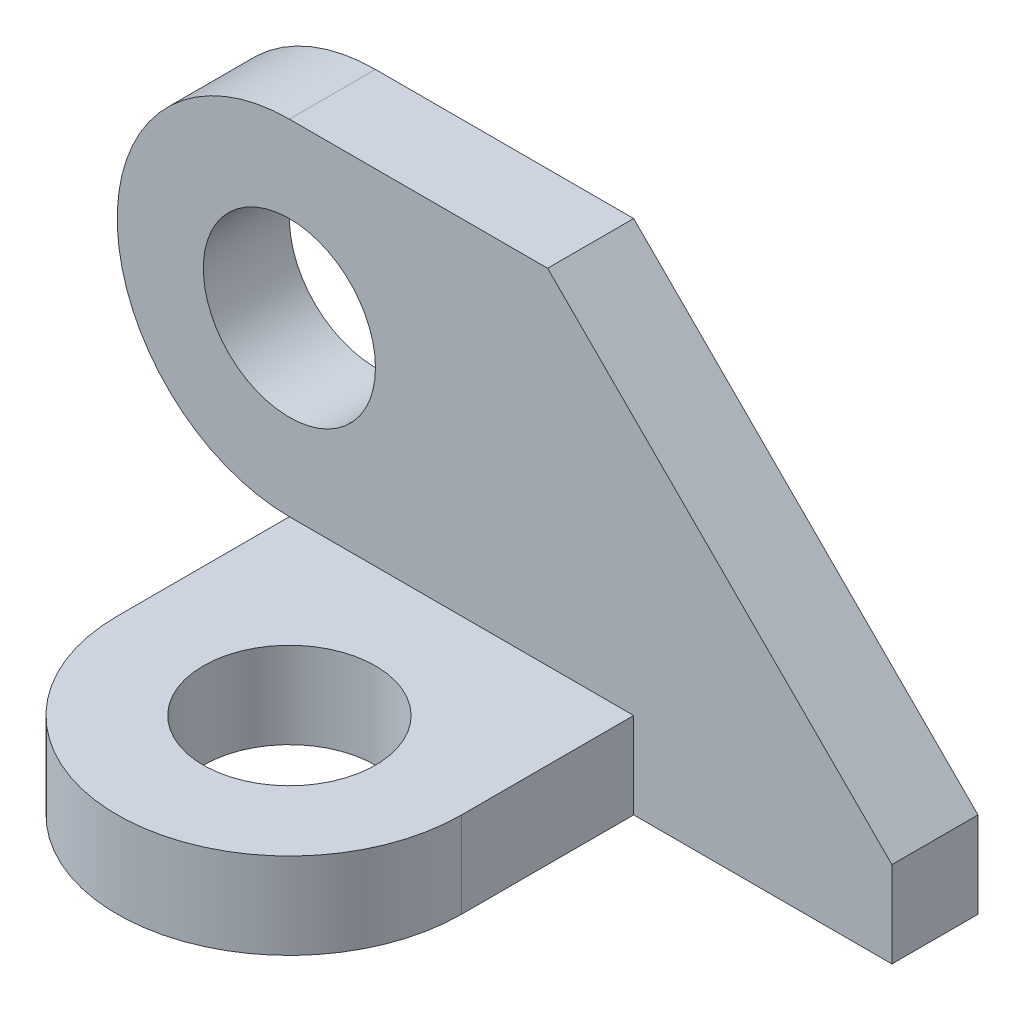
ISO-10303-21;
HEADER;
FILE_DESCRIPTION(('STEP AP214'),'2;1');
FILE_NAME('part.step','',(''),(''),'','','');
FILE_SCHEMA(('AUTOMOTIVE_DESIGN { 1 0 10303 214 1 1 1 1 }'));
ENDSEC;
DATA;
#1=APPLICATION_CONTEXT('core data for automotive mechanical design processes');
#2=APPLICATION_PROTOCOL_DEFINITION('international standard','automotive_design',2000,#1);
#3=PRODUCT_CONTEXT('',#1,'mechanical');
#4=PRODUCT('Part','Part','',(#3));
#5=PRODUCT_RELATED_PRODUCT_CATEGORY('part','',(#4));
#6=PRODUCT_DEFINITION_FORMATION('','',#4);
#7=PRODUCT_DEFINITION_CONTEXT('part definition',#1,'design');
#8=PRODUCT_DEFINITION('design','',#6,#7);
#9=PRODUCT_DEFINITION_SHAPE('','',#8);
#10=(LENGTH_UNIT() NAMED_UNIT(*) SI_UNIT(.MILLI.,.METRE.));
#11=(NAMED_UNIT(*) PLANE_ANGLE_UNIT() SI_UNIT($,.RADIAN.));
#12=(NAMED_UNIT(*) SI_UNIT($,.STERADIAN.) SOLID_ANGLE_UNIT());
#13=UNCERTAINTY_MEASURE_WITH_UNIT(LENGTH_MEASURE(1.E-05),#10,'distance_accuracy_value','');
#14=(GEOMETRIC_REPRESENTATION_CONTEXT(3) GLOBAL_UNCERTAINTY_ASSIGNED_CONTEXT((#13)) GLOBAL_UNIT_ASSIGNED_CONTEXT((#10,
#11,#12)) REPRESENTATION_CONTEXT('',''));
#15=CARTESIAN_POINT('',(0.,0.,0.));
#16=DIRECTION('',(0.,0.,1.));
#17=DIRECTION('',(1.,0.,0.));
#18=AXIS2_PLACEMENT_3D('',#15,#16,#17);
#19=CARTESIAN_POINT('',(9.11911403543225,-4.91118256405402,5.44044298228388));
#20=DIRECTION('',(0.,0.,1.));
#21=DIRECTION('',(1.,0.,0.));
#22=AXIS2_PLACEMENT_3D('',#19,#20,#21);
#23=PLANE('',#22);
#24=DIRECTION('',(-1.,0.,0.));
#25=VECTOR('',#24,1.);
#26=CARTESIAN_POINT('',(16.1191140354323,-6.91118256405402,5.44044298228388));
#27=LINE('',#26,#25);
#28=CARTESIAN_POINT('',(13.1191140354323,-6.91118256405402,5.44044298228388));
#29=VERTEX_POINT('',#28);
#30=CARTESIAN_POINT('',(9.11911403543225,-6.91118256405402,5.44044298228388));
#31=VERTEX_POINT('',#30);
#32=EDGE_CURVE('E120',#29,#31,#27,.T.);
#33=ORIENTED_EDGE('',*,*,#32,.F.);
#34=DIRECTION('',(0.,-1.,0.));
#35=VECTOR('',#34,1.);
#36=CARTESIAN_POINT('',(13.1191140354323,-6.91118256405402,5.44044298228388));
#37=LINE('',#36,#35);
#38=CARTESIAN_POINT('',(13.1191140354323,-7.91118256405402,5.44044298228388));
#39=VERTEX_POINT('',#38);
#40=EDGE_CURVE('E117',#29,#39,#37,.T.);
#41=ORIENTED_EDGE('',*,*,#40,.T.);
#42=DIRECTION('',(1.,0.,0.));
#43=VECTOR('',#42,1.);
#44=CARTESIAN_POINT('',(16.1191140354323,-7.91118256405402,5.44044298228388));
#45=LINE('',#44,#43);
#46=CARTESIAN_POINT('',(16.1191140354323,-7.91118256405402,5.44044298228388));
#47=VERTEX_POINT('',#46);
#48=EDGE_CURVE('E93',#39,#47,#45,.T.);
#49=ORIENTED_EDGE('',*,*,#48,.T.);
#50=DIRECTION('',(0.,1.,0.));
#51=VECTOR('',#50,1.);
#52=CARTESIAN_POINT('',(16.1191140354323,-6.91118256405402,5.44044298228388));
#53=LINE('',#52,#51);
#54=CARTESIAN_POINT('',(16.1191140354323,-6.91118256405402,5.44044298228388));
#55=VERTEX_POINT('',#54);
#56=EDGE_CURVE('E150',#47,#55,#53,.T.);
#57=ORIENTED_EDGE('',*,*,#56,.T.);
#58=DIRECTION('',(-0.707106781186548,0.707106781186547,0.));
#59=VECTOR('',#58,1.);
#60=CARTESIAN_POINT('',(12.1191140354322,-2.91118256405402,5.44044298228388));
#61=LINE('',#60,#59);
#62=CARTESIAN_POINT('',(12.1191140354322,-2.91118256405402,5.44044298228388));
#63=VERTEX_POINT('',#62);
#64=EDGE_CURVE('E152',#55,#63,#61,.T.);
#65=ORIENTED_EDGE('',*,*,#64,.T.);
#66=DIRECTION('',(-1.,0.,0.));
#67=VECTOR('',#66,1.);
#68=CARTESIAN_POINT('',(9.11911403543225,-2.91118256405402,5.44044298228388));
#69=LINE('',#68,#67);
#70=CARTESIAN_POINT('',(9.11911403543225,-2.91118256405402,5.44044298228388));
#71=VERTEX_POINT('',#70);
#72=EDGE_CURVE('E60',#63,#71,#69,.T.);
#73=ORIENTED_EDGE('',*,*,#72,.T.);
#74=CARTESIAN_POINT('',(9.11911403543225,-4.91118256405402,5.44044298228388));
#75=DIRECTION('',(0.,0.,1.));
#76=DIRECTION('',(1.,0.,0.));
#77=AXIS2_PLACEMENT_3D('',#74,#75,#76);
#78=CIRCLE('',#77,2.);
#79=EDGE_CURVE('E147',#71,#31,#78,.T.);
#80=ORIENTED_EDGE('',*,*,#79,.T.);
#81=EDGE_LOOP('',(#33,#41,#49,#57,#65,#73,#80));
#82=FACE_BOUND('',#81,.T.);
#83=CARTESIAN_POINT('',(9.11911403543225,-4.91118256405402,5.44044298228388));
#84=DIRECTION('',(0.,0.,1.));
#85=DIRECTION('',(1.,0.,0.));
#86=AXIS2_PLACEMENT_3D('',#83,#84,#85);
#87=CIRCLE('',#86,1.);
#88=CARTESIAN_POINT('',(10.1191140354322,-4.91118256405402,5.44044298228388));
#89=VERTEX_POINT('',#88);
#90=EDGE_CURVE('E138',#89,#89,#87,.T.);
#91=ORIENTED_EDGE('',*,*,#90,.F.);
#92=EDGE_LOOP('',(#91));
#93=FACE_BOUND('',#92,.T.);
#94=ADVANCED_FACE('F36',(#82,#93),#23,.T.);
#95=CARTESIAN_POINT('',(9.11911403543225,-4.91118256405402,4.44044298228387));
#96=DIRECTION('',(0.,0.,1.));
#97=DIRECTION('',(1.,0.,0.));
#98=AXIS2_PLACEMENT_3D('',#95,#96,#97);
#99=PLANE('',#98);
#100=CARTESIAN_POINT('',(9.11911403543225,-4.91118256405402,4.44044298228387));
#101=DIRECTION('',(0.,0.,1.));
#102=DIRECTION('',(1.,0.,0.));
#103=AXIS2_PLACEMENT_3D('',#100,#101,#102);
#104=CIRCLE('',#103,2.);
#105=CARTESIAN_POINT('',(9.11911403543225,-2.91118256405402,4.44044298228387));
#106=VERTEX_POINT('',#105);
#107=CARTESIAN_POINT('',(9.11911403543225,-6.91118256405402,4.44044298228387));
#108=VERTEX_POINT('',#107);
#109=EDGE_CURVE('E145',#106,#108,#104,.T.);
#110=ORIENTED_EDGE('',*,*,#109,.F.);
#111=DIRECTION('',(-1.,0.,0.));
#112=VECTOR('',#111,1.);
#113=CARTESIAN_POINT('',(9.11911403543225,-2.91118256405402,4.44044298228387));
#114=LINE('',#113,#112);
#115=CARTESIAN_POINT('',(12.1191140354322,-2.91118256405402,4.44044298228387));
#116=VERTEX_POINT('',#115);
#117=EDGE_CURVE('E87',#116,#106,#114,.T.);
#118=ORIENTED_EDGE('',*,*,#117,.F.);
#119=DIRECTION('',(-0.707106781186548,0.707106781186547,0.));
#120=VECTOR('',#119,1.);
#121=CARTESIAN_POINT('',(12.1191140354322,-2.91118256405402,4.44044298228387));
#122=LINE('',#121,#120);
#123=CARTESIAN_POINT('',(16.1191140354323,-6.91118256405402,4.44044298228387));
#124=VERTEX_POINT('',#123);
#125=EDGE_CURVE('E164',#124,#116,#122,.T.);
#126=ORIENTED_EDGE('',*,*,#125,.F.);
#127=DIRECTION('',(0.,1.,0.));
#128=VECTOR('',#127,1.);
#129=CARTESIAN_POINT('',(16.1191140354323,-6.91118256405402,4.44044298228387));
#130=LINE('',#129,#128);
#131=CARTESIAN_POINT('',(16.1191140354323,-7.91118256405402,4.44044298228387));
#132=VERTEX_POINT('',#131);
#133=EDGE_CURVE('E162',#132,#124,#130,.T.);
#134=ORIENTED_EDGE('',*,*,#133,.F.);
#135=DIRECTION('',(1.,0.,0.));
#136=VECTOR('',#135,1.);
#137=CARTESIAN_POINT('',(16.1191140354323,-7.91118256405402,4.44044298228387));
#138=LINE('',#137,#136);
#139=CARTESIAN_POINT('',(9.11911403543225,-7.91118256405402,4.44044298228387));
#140=VERTEX_POINT('',#139);
#141=EDGE_CURVE('E160',#140,#132,#138,.T.);
#142=ORIENTED_EDGE('',*,*,#141,.F.);
#143=DIRECTION('',(0.,-1.,0.));
#144=VECTOR('',#143,1.);
#145=CARTESIAN_POINT('',(9.11911403543225,-7.91118256405402,4.44044298228387));
#146=LINE('',#145,#144);
#147=EDGE_CURVE('E158',#108,#140,#146,.T.);
#148=ORIENTED_EDGE('',*,*,#147,.F.);
#149=EDGE_LOOP('',(#110,#118,#126,#134,#142,#148));
#150=FACE_BOUND('',#149,.T.);
#151=CARTESIAN_POINT('',(9.11911403543225,-4.91118256405402,4.44044298228387));
#152=DIRECTION('',(0.,0.,1.));
#153=DIRECTION('',(1.,0.,0.));
#154=AXIS2_PLACEMENT_3D('',#151,#152,#153);
#155=CIRCLE('',#154,1.);
#156=CARTESIAN_POINT('',(10.1191140354322,-4.91118256405402,4.44044298228387));
#157=VERTEX_POINT('',#156);
#158=EDGE_CURVE('E135',#157,#157,#155,.T.);
#159=ORIENTED_EDGE('',*,*,#158,.T.);
#160=EDGE_LOOP('',(#159));
#161=FACE_BOUND('',#160,.T.);
#162=ADVANCED_FACE('F184',(#150,#161),#99,.F.);
#163=CARTESIAN_POINT('',(9.11911403543225,-4.91118256405402,5.44044298228388));
#164=DIRECTION('',(0.,0.,-1.));
#165=DIRECTION('',(-1.,0.,0.));
#166=AXIS2_PLACEMENT_3D('',#163,#164,#165);
#167=CYLINDRICAL_SURFACE('',#166,2.);
#168=ORIENTED_EDGE('',*,*,#109,.T.);
#169=DIRECTION('',(0.,0.,-1.));
#170=VECTOR('',#169,1.);
#171=CARTESIAN_POINT('',(9.11911403543225,-6.91118256405402,5.44044298228388));
#172=LINE('',#171,#170);
#173=EDGE_CURVE('E11',#31,#108,#172,.T.);
#174=ORIENTED_EDGE('',*,*,#173,.F.);
#175=ORIENTED_EDGE('',*,*,#79,.F.);
#176=DIRECTION('',(0.,0.,-1.));
#177=VECTOR('',#176,1.);
#178=CARTESIAN_POINT('',(9.11911403543225,-2.91118256405402,5.44044298228388));
#179=LINE('',#178,#177);
#180=EDGE_CURVE('E155',#71,#106,#179,.T.);
#181=ORIENTED_EDGE('',*,*,#180,.T.);
#182=EDGE_LOOP('',(#168,#174,#175,#181));
#183=FACE_BOUND('',#182,.T.);
#184=ADVANCED_FACE('F38',(#183),#167,.T.);
#185=CARTESIAN_POINT('',(9.11911403543225,-7.91118256405402,5.44044298228388));
#186=DIRECTION('',(1.,0.,0.));
#187=DIRECTION('',(0.,0.,-1.));
#188=AXIS2_PLACEMENT_3D('',#185,#186,#187);
#189=PLANE('',#188);
#190=ORIENTED_EDGE('',*,*,#147,.T.);
#191=DIRECTION('',(0.,0.,-1.));
#192=VECTOR('',#191,1.);
#193=CARTESIAN_POINT('',(9.11911403543225,-7.91118256405402,5.44044298228388));
#194=LINE('',#193,#192);
#195=CARTESIAN_POINT('',(9.11911403543225,-7.91118256405402,7.44044298228388));
#196=VERTEX_POINT('',#195);
#197=EDGE_CURVE('E44',#196,#140,#194,.T.);
#198=ORIENTED_EDGE('',*,*,#197,.F.);
#199=DIRECTION('',(0.,-1.,0.));
#200=VECTOR('',#199,1.);
#201=CARTESIAN_POINT('',(9.11911403543225,-6.91118256405402,7.44044298228388));
#202=LINE('',#201,#200);
#203=CARTESIAN_POINT('',(9.11911403543225,-6.91118256405402,7.44044298228388));
#204=VERTEX_POINT('',#203);
#205=EDGE_CURVE('E140',#204,#196,#202,.T.);
#206=ORIENTED_EDGE('',*,*,#205,.F.);
#207=DIRECTION('',(0.,0.,1.));
#208=VECTOR('',#207,1.);
#209=CARTESIAN_POINT('',(9.11911403543225,-6.91118256405402,5.44044298228388));
#210=LINE('',#209,#208);
#211=EDGE_CURVE('E127',#31,#204,#210,.T.);
#212=ORIENTED_EDGE('',*,*,#211,.F.);
#213=ORIENTED_EDGE('',*,*,#173,.T.);
#214=EDGE_LOOP('',(#190,#198,#206,#212,#213));
#215=FACE_BOUND('',#214,.T.);
#216=ADVANCED_FACE('F211',(#215),#189,.F.);
#217=CARTESIAN_POINT('',(16.1191140354323,-7.91118256405402,5.44044298228388));
#218=DIRECTION('',(0.,1.,0.));
#219=DIRECTION('',(-1.,0.,0.));
#220=AXIS2_PLACEMENT_3D('',#217,#218,#219);
#221=PLANE('',#220);
#222=ORIENTED_EDGE('',*,*,#141,.T.);
#223=DIRECTION('',(0.,0.,-1.));
#224=VECTOR('',#223,1.);
#225=CARTESIAN_POINT('',(16.1191140354323,-7.91118256405402,5.44044298228388));
#226=LINE('',#225,#224);
#227=EDGE_CURVE('E173',#47,#132,#226,.T.);
#228=ORIENTED_EDGE('',*,*,#227,.F.);
#229=ORIENTED_EDGE('',*,*,#48,.F.);
#230=DIRECTION('',(0.,0.,-1.));
#231=VECTOR('',#230,1.);
#232=CARTESIAN_POINT('',(13.1191140354323,-7.91118256405402,5.44044298228388));
#233=LINE('',#232,#231);
#234=CARTESIAN_POINT('',(13.1191140354323,-7.91118256405402,7.44044298228388));
#235=VERTEX_POINT('',#234);
#236=EDGE_CURVE('E51',#235,#39,#233,.T.);
#237=ORIENTED_EDGE('',*,*,#236,.F.);
#238=CARTESIAN_POINT('',(11.1191140354323,-7.91118256405402,7.44044298228388));
#239=DIRECTION('',(0.,1.,0.));
#240=DIRECTION('',(-1.,0.,0.));
#241=AXIS2_PLACEMENT_3D('',#238,#239,#240);
#242=CIRCLE('',#241,2.);
#243=EDGE_CURVE('E134',#196,#235,#242,.T.);
#244=ORIENTED_EDGE('',*,*,#243,.F.);
#245=ORIENTED_EDGE('',*,*,#197,.T.);
#246=EDGE_LOOP('',(#222,#228,#229,#237,#244,#245));
#247=FACE_BOUND('',#246,.T.);
#248=CARTESIAN_POINT('',(11.1191140354323,-7.91118256405402,7.44044298228388));
#249=DIRECTION('',(0.,1.,0.));
#250=DIRECTION('',(-1.,0.,0.));
#251=AXIS2_PLACEMENT_3D('',#248,#249,#250);
#252=CIRCLE('',#251,1.);
#253=CARTESIAN_POINT('',(10.1191140354322,-7.91118256405402,7.44044298228388));
#254=VERTEX_POINT('',#253);
#255=EDGE_CURVE('E232',#254,#254,#252,.T.);
#256=ORIENTED_EDGE('',*,*,#255,.T.);
#257=EDGE_LOOP('',(#256));
#258=FACE_BOUND('',#257,.T.);
#259=ADVANCED_FACE('F178',(#247,#258),#221,.F.);
#260=CARTESIAN_POINT('',(16.1191140354323,-6.91118256405402,5.44044298228388));
#261=DIRECTION('',(-1.,0.,0.));
#262=DIRECTION('',(0.,0.,1.));
#263=AXIS2_PLACEMENT_3D('',#260,#261,#262);
#264=PLANE('',#263);
#265=ORIENTED_EDGE('',*,*,#133,.T.);
#266=DIRECTION('',(0.,0.,-1.));
#267=VECTOR('',#266,1.);
#268=CARTESIAN_POINT('',(16.1191140354323,-6.91118256405402,5.44044298228388));
#269=LINE('',#268,#267);
#270=EDGE_CURVE('E170',#55,#124,#269,.T.);
#271=ORIENTED_EDGE('',*,*,#270,.F.);
#272=ORIENTED_EDGE('',*,*,#56,.F.);
#273=ORIENTED_EDGE('',*,*,#227,.T.);
#274=EDGE_LOOP('',(#265,#271,#272,#273));
#275=FACE_BOUND('',#274,.T.);
#276=ADVANCED_FACE('F189',(#275),#264,.F.);
#277=CARTESIAN_POINT('',(12.1191140354322,-2.91118256405402,5.44044298228388));
#278=DIRECTION('',(-0.707106781186547,-0.707106781186548,0.));
#279=DIRECTION('',(0.707106781186548,-0.707106781186547,0.));
#280=AXIS2_PLACEMENT_3D('',#277,#278,#279);
#281=PLANE('',#280);
#282=ORIENTED_EDGE('',*,*,#125,.T.);
#283=DIRECTION('',(0.,0.,-1.));
#284=VECTOR('',#283,1.);
#285=CARTESIAN_POINT('',(12.1191140354322,-2.91118256405402,5.44044298228388));
#286=LINE('',#285,#284);
#287=EDGE_CURVE('E168',#63,#116,#286,.T.);
#288=ORIENTED_EDGE('',*,*,#287,.F.);
#289=ORIENTED_EDGE('',*,*,#64,.F.);
#290=ORIENTED_EDGE('',*,*,#270,.T.);
#291=EDGE_LOOP('',(#282,#288,#289,#290));
#292=FACE_BOUND('',#291,.T.);
#293=ADVANCED_FACE('F193',(#292),#281,.F.);
#294=CARTESIAN_POINT('',(9.11911403543225,-2.91118256405402,5.44044298228388));
#295=DIRECTION('',(0.,-1.,0.));
#296=DIRECTION('',(1.,0.,0.));
#297=AXIS2_PLACEMENT_3D('',#294,#295,#296);
#298=PLANE('',#297);
#299=ORIENTED_EDGE('',*,*,#117,.T.);
#300=ORIENTED_EDGE('',*,*,#180,.F.);
#301=ORIENTED_EDGE('',*,*,#72,.F.);
#302=ORIENTED_EDGE('',*,*,#287,.T.);
#303=EDGE_LOOP('',(#299,#300,#301,#302));
#304=FACE_BOUND('',#303,.T.);
#305=ADVANCED_FACE('F203',(#304),#298,.F.);
#306=CARTESIAN_POINT('',(9.11911403543225,-4.91118256405402,5.44044298228388));
#307=DIRECTION('',(0.,0.,-1.));
#308=DIRECTION('',(-1.,0.,0.));
#309=AXIS2_PLACEMENT_3D('',#306,#307,#308);
#310=CYLINDRICAL_SURFACE('',#309,1.);
#311=ORIENTED_EDGE('',*,*,#90,.T.);
#312=EDGE_LOOP('',(#311));
#313=FACE_BOUND('',#312,.T.);
#314=ORIENTED_EDGE('',*,*,#158,.F.);
#315=EDGE_LOOP('',(#314));
#316=FACE_BOUND('',#315,.T.);
#317=ADVANCED_FACE('F200',(#313,#316),#310,.F.);
#318=CARTESIAN_POINT('',(11.1191140354323,-6.91118256405402,7.44044298228388));
#319=DIRECTION('',(0.,1.,0.));
#320=DIRECTION('',(-1.,0.,0.));
#321=AXIS2_PLACEMENT_3D('',#318,#319,#320);
#322=PLANE('',#321);
#323=CARTESIAN_POINT('',(11.1191140354323,-6.91118256405402,7.44044298228388));
#324=DIRECTION('',(0.,1.,0.));
#325=DIRECTION('',(-1.,0.,0.));
#326=AXIS2_PLACEMENT_3D('',#323,#324,#325);
#327=CIRCLE('',#326,2.);
#328=CARTESIAN_POINT('',(13.1191140354323,-6.91118256405402,7.44044298228388));
#329=VERTEX_POINT('',#328);
#330=EDGE_CURVE('E121',#204,#329,#327,.T.);
#331=ORIENTED_EDGE('',*,*,#330,.T.);
#332=DIRECTION('',(0.,0.,-1.));
#333=VECTOR('',#332,1.);
#334=CARTESIAN_POINT('',(13.1191140354323,-6.91118256405402,5.44044298228388));
#335=LINE('',#334,#333);
#336=EDGE_CURVE('E111',#329,#29,#335,.T.);
#337=ORIENTED_EDGE('',*,*,#336,.T.);
#338=ORIENTED_EDGE('',*,*,#32,.T.);
#339=ORIENTED_EDGE('',*,*,#211,.T.);
#340=EDGE_LOOP('',(#331,#337,#338,#339));
#341=FACE_BOUND('',#340,.T.);
#342=CARTESIAN_POINT('',(11.1191140354323,-6.91118256405402,7.44044298228388));
#343=DIRECTION('',(0.,1.,0.));
#344=DIRECTION('',(-1.,0.,0.));
#345=AXIS2_PLACEMENT_3D('',#342,#343,#344);
#346=CIRCLE('',#345,1.);
#347=CARTESIAN_POINT('',(10.1191140354322,-6.91118256405402,7.44044298228388));
#348=VERTEX_POINT('',#347);
#349=EDGE_CURVE('E230',#348,#348,#346,.T.);
#350=ORIENTED_EDGE('',*,*,#349,.F.);
#351=EDGE_LOOP('',(#350));
#352=FACE_BOUND('',#351,.T.);
#353=ADVANCED_FACE('F124',(#341,#352),#322,.T.);
#354=CARTESIAN_POINT('',(11.1191140354323,-6.91118256405402,7.44044298228388));
#355=DIRECTION('',(0.,-1.,0.));
#356=DIRECTION('',(0.,0.,-1.));
#357=AXIS2_PLACEMENT_3D('',#354,#355,#356);
#358=CYLINDRICAL_SURFACE('',#357,2.);
#359=ORIENTED_EDGE('',*,*,#243,.T.);
#360=DIRECTION('',(0.,-1.,0.));
#361=VECTOR('',#360,1.);
#362=CARTESIAN_POINT('',(13.1191140354323,-6.91118256405402,7.44044298228388));
#363=LINE('',#362,#361);
#364=EDGE_CURVE('E115',#329,#235,#363,.T.);
#365=ORIENTED_EDGE('',*,*,#364,.F.);
#366=ORIENTED_EDGE('',*,*,#330,.F.);
#367=ORIENTED_EDGE('',*,*,#205,.T.);
#368=EDGE_LOOP('',(#359,#365,#366,#367));
#369=FACE_BOUND('',#368,.T.);
#370=ADVANCED_FACE('F132',(#369),#358,.T.);
#371=CARTESIAN_POINT('',(13.1191140354323,-6.91118256405402,5.44044298228388));
#372=DIRECTION('',(-1.,0.,0.));
#373=DIRECTION('',(0.,0.,1.));
#374=AXIS2_PLACEMENT_3D('',#371,#372,#373);
#375=PLANE('',#374);
#376=ORIENTED_EDGE('',*,*,#236,.T.);
#377=ORIENTED_EDGE('',*,*,#40,.F.);
#378=ORIENTED_EDGE('',*,*,#336,.F.);
#379=ORIENTED_EDGE('',*,*,#364,.T.);
#380=EDGE_LOOP('',(#376,#377,#378,#379));
#381=FACE_BOUND('',#380,.T.);
#382=ADVANCED_FACE('F113',(#381),#375,.F.);
#383=CARTESIAN_POINT('',(11.1191140354323,-6.91118256405402,7.44044298228388));
#384=DIRECTION('',(0.,-1.,0.));
#385=DIRECTION('',(0.,0.,-1.));
#386=AXIS2_PLACEMENT_3D('',#383,#384,#385);
#387=CYLINDRICAL_SURFACE('',#386,1.);
#388=ORIENTED_EDGE('',*,*,#349,.T.);
#389=EDGE_LOOP('',(#388));
#390=FACE_BOUND('',#389,.T.);
#391=ORIENTED_EDGE('',*,*,#255,.F.);
#392=EDGE_LOOP('',(#391));
#393=FACE_BOUND('',#392,.T.);
#394=ADVANCED_FACE('F240',(#390,#393),#387,.F.);
#395=CLOSED_SHELL('',(#94,#162,#184,#216,#259,#276,#293,#305,#317,#353,#370,#382,#394));
#396=MANIFOLD_SOLID_BREP('B2',#395);
#397=ADVANCED_BREP_SHAPE_REPRESENTATION('',(#18,#396),#14);
#398=SHAPE_DEFINITION_REPRESENTATION(#9,#397);
ENDSEC;
END-ISO-10303-21;
